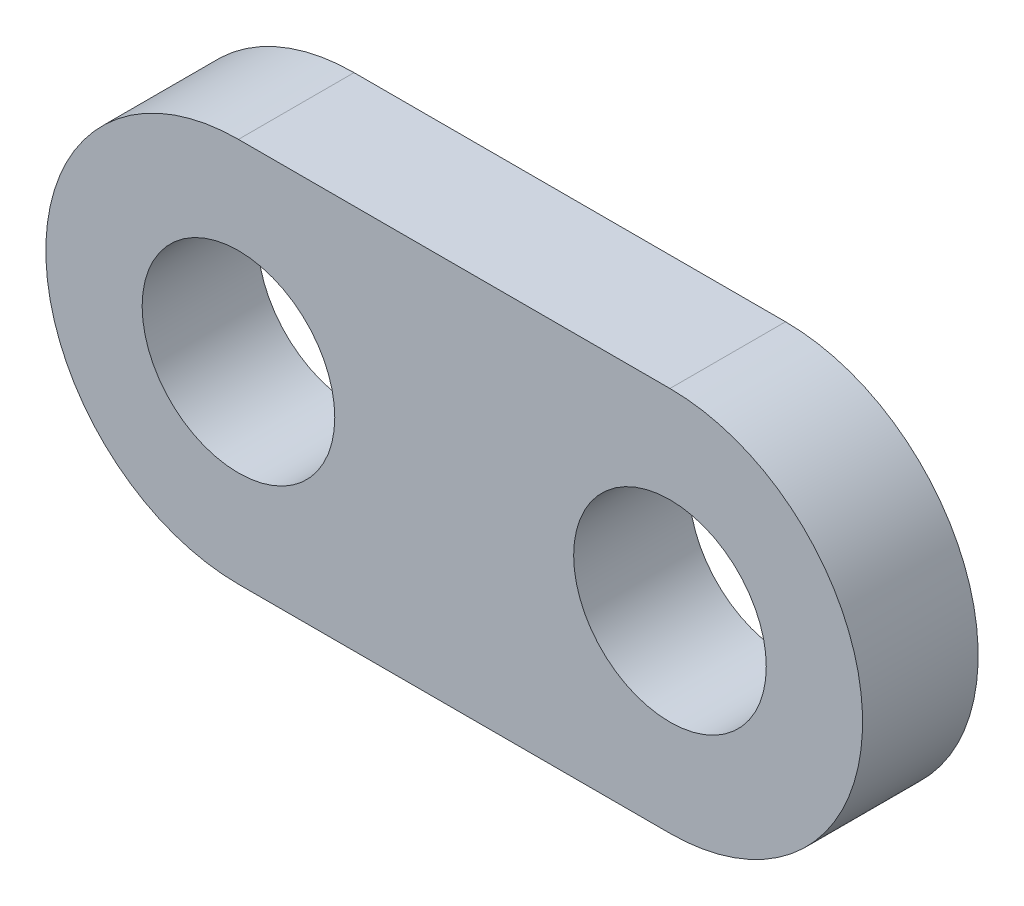
ISO-10303-21;
HEADER;
FILE_DESCRIPTION(('STEP AP214'),'2;1');
FILE_NAME('part.step','',(''),(''),'','','');
FILE_SCHEMA(('AUTOMOTIVE_DESIGN { 1 0 10303 214 1 1 1 1 }'));
ENDSEC;
DATA;
#1=APPLICATION_CONTEXT('core data for automotive mechanical design processes');
#2=APPLICATION_PROTOCOL_DEFINITION('international standard','automotive_design',2000,#1);
#3=PRODUCT_CONTEXT('',#1,'mechanical');
#4=PRODUCT('Part','Part','',(#3));
#5=PRODUCT_RELATED_PRODUCT_CATEGORY('part','',(#4));
#6=PRODUCT_DEFINITION_FORMATION('','',#4);
#7=PRODUCT_DEFINITION_CONTEXT('part definition',#1,'design');
#8=PRODUCT_DEFINITION('design','',#6,#7);
#9=PRODUCT_DEFINITION_SHAPE('','',#8);
#10=(LENGTH_UNIT() NAMED_UNIT(*) SI_UNIT(.MILLI.,.METRE.));
#11=(NAMED_UNIT(*) PLANE_ANGLE_UNIT() SI_UNIT($,.RADIAN.));
#12=(NAMED_UNIT(*) SI_UNIT($,.STERADIAN.) SOLID_ANGLE_UNIT());
#13=UNCERTAINTY_MEASURE_WITH_UNIT(LENGTH_MEASURE(1.E-05),#10,'distance_accuracy_value','');
#14=(GEOMETRIC_REPRESENTATION_CONTEXT(3) GLOBAL_UNCERTAINTY_ASSIGNED_CONTEXT((#13)) GLOBAL_UNIT_ASSIGNED_CONTEXT((#10,
#11,#12)) REPRESENTATION_CONTEXT('',''));
#15=CARTESIAN_POINT('',(0.,0.,0.));
#16=DIRECTION('',(0.,0.,1.));
#17=DIRECTION('',(1.,0.,0.));
#18=AXIS2_PLACEMENT_3D('',#15,#16,#17);
#19=CARTESIAN_POINT('',(-11.22423390278,0.,6.));
#20=DIRECTION('',(0.,0.,1.));
#21=DIRECTION('',(1.,0.,0.));
#22=AXIS2_PLACEMENT_3D('',#19,#20,#21);
#23=PLANE('',#22);
#24=CARTESIAN_POINT('',(-11.22423390278,0.,6.));
#25=DIRECTION('',(0.,0.,1.));
#26=DIRECTION('',(1.,0.,0.));
#27=AXIS2_PLACEMENT_3D('',#24,#25,#26);
#28=CIRCLE('',#27,5.);
#29=CARTESIAN_POINT('',(-6.22423390278005,0.,6.));
#30=VERTEX_POINT('',#29);
#31=EDGE_CURVE('E112',#30,#30,#28,.T.);
#32=ORIENTED_EDGE('',*,*,#31,.F.);
#33=EDGE_LOOP('',(#32));
#34=FACE_BOUND('',#33,.T.);
#35=CARTESIAN_POINT('',(-11.22423390278,0.,6.));
#36=DIRECTION('',(0.,0.,1.));
#37=DIRECTION('',(1.,0.,0.));
#38=AXIS2_PLACEMENT_3D('',#35,#36,#37);
#39=CIRCLE('',#38,10.);
#40=CARTESIAN_POINT('',(-11.22423390278,10.,6.));
#41=VERTEX_POINT('',#40);
#42=CARTESIAN_POINT('',(-11.22423390278,-10.,6.));
#43=VERTEX_POINT('',#42);
#44=EDGE_CURVE('E92',#41,#43,#39,.T.);
#45=ORIENTED_EDGE('',*,*,#44,.T.);
#46=DIRECTION('',(1.,0.,0.));
#47=VECTOR('',#46,1.);
#48=CARTESIAN_POINT('',(-11.22423390278,-10.,6.));
#49=LINE('',#48,#47);
#50=CARTESIAN_POINT('',(11.1757660972199,-10.,6.));
#51=VERTEX_POINT('',#50);
#52=EDGE_CURVE('E87',#43,#51,#49,.T.);
#53=ORIENTED_EDGE('',*,*,#52,.T.);
#54=CARTESIAN_POINT('',(11.17576609722,0.,6.));
#55=DIRECTION('',(0.,0.,1.));
#56=DIRECTION('',(1.,0.,0.));
#57=AXIS2_PLACEMENT_3D('',#54,#55,#56);
#58=CIRCLE('',#57,10.);
#59=CARTESIAN_POINT('',(11.17576609722,10.,6.));
#60=VERTEX_POINT('',#59);
#61=EDGE_CURVE('E90',#51,#60,#58,.T.);
#62=ORIENTED_EDGE('',*,*,#61,.T.);
#63=DIRECTION('',(-1.,0.,0.));
#64=VECTOR('',#63,1.);
#65=CARTESIAN_POINT('',(-11.22423390278,10.,6.));
#66=LINE('',#65,#64);
#67=EDGE_CURVE('E57',#60,#41,#66,.T.);
#68=ORIENTED_EDGE('',*,*,#67,.T.);
#69=EDGE_LOOP('',(#45,#53,#62,#68));
#70=FACE_BOUND('',#69,.T.);
#71=CARTESIAN_POINT('',(11.17576609722,0.,6.));
#72=DIRECTION('',(0.,0.,1.));
#73=DIRECTION('',(1.,0.,0.));
#74=AXIS2_PLACEMENT_3D('',#71,#72,#73);
#75=CIRCLE('',#74,5.);
#76=CARTESIAN_POINT('',(16.17576609722,0.,6.));
#77=VERTEX_POINT('',#76);
#78=EDGE_CURVE('E134',#77,#77,#75,.T.);
#79=ORIENTED_EDGE('',*,*,#78,.F.);
#80=EDGE_LOOP('',(#79));
#81=FACE_BOUND('',#80,.T.);
#82=ADVANCED_FACE('F39',(#34,#70,#81),#23,.T.);
#83=CARTESIAN_POINT('',(-11.22423390278,0.,0.));
#84=DIRECTION('',(0.,0.,1.));
#85=DIRECTION('',(1.,0.,0.));
#86=AXIS2_PLACEMENT_3D('',#83,#84,#85);
#87=PLANE('',#86);
#88=CARTESIAN_POINT('',(-11.22423390278,0.,0.));
#89=DIRECTION('',(0.,0.,1.));
#90=DIRECTION('',(1.,0.,0.));
#91=AXIS2_PLACEMENT_3D('',#88,#89,#90);
#92=CIRCLE('',#91,10.);
#93=CARTESIAN_POINT('',(-11.22423390278,10.,0.));
#94=VERTEX_POINT('',#93);
#95=CARTESIAN_POINT('',(-11.22423390278,-10.,0.));
#96=VERTEX_POINT('',#95);
#97=EDGE_CURVE('E108',#94,#96,#92,.T.);
#98=ORIENTED_EDGE('',*,*,#97,.F.);
#99=DIRECTION('',(-1.,0.,0.));
#100=VECTOR('',#99,1.);
#101=CARTESIAN_POINT('',(-11.22423390278,10.,0.));
#102=LINE('',#101,#100);
#103=CARTESIAN_POINT('',(11.17576609722,10.,0.));
#104=VERTEX_POINT('',#103);
#105=EDGE_CURVE('E80',#104,#94,#102,.T.);
#106=ORIENTED_EDGE('',*,*,#105,.F.);
#107=CARTESIAN_POINT('',(11.17576609722,0.,0.));
#108=DIRECTION('',(0.,0.,1.));
#109=DIRECTION('',(1.,0.,0.));
#110=AXIS2_PLACEMENT_3D('',#107,#108,#109);
#111=CIRCLE('',#110,10.);
#112=CARTESIAN_POINT('',(11.1757660972199,-10.,0.));
#113=VERTEX_POINT('',#112);
#114=EDGE_CURVE('E74',#113,#104,#111,.T.);
#115=ORIENTED_EDGE('',*,*,#114,.F.);
#116=DIRECTION('',(1.,0.,0.));
#117=VECTOR('',#116,1.);
#118=CARTESIAN_POINT('',(-11.22423390278,-10.,0.));
#119=LINE('',#118,#117);
#120=EDGE_CURVE('E97',#96,#113,#119,.T.);
#121=ORIENTED_EDGE('',*,*,#120,.F.);
#122=EDGE_LOOP('',(#98,#106,#115,#121));
#123=FACE_BOUND('',#122,.T.);
#124=CARTESIAN_POINT('',(-11.22423390278,0.,0.));
#125=DIRECTION('',(0.,0.,1.));
#126=DIRECTION('',(1.,0.,0.));
#127=AXIS2_PLACEMENT_3D('',#124,#125,#126);
#128=CIRCLE('',#127,5.);
#129=CARTESIAN_POINT('',(-6.22423390278005,0.,0.));
#130=VERTEX_POINT('',#129);
#131=EDGE_CURVE('E130',#130,#130,#128,.T.);
#132=ORIENTED_EDGE('',*,*,#131,.T.);
#133=EDGE_LOOP('',(#132));
#134=FACE_BOUND('',#133,.T.);
#135=CARTESIAN_POINT('',(11.17576609722,0.,0.));
#136=DIRECTION('',(0.,0.,1.));
#137=DIRECTION('',(1.,0.,0.));
#138=AXIS2_PLACEMENT_3D('',#135,#136,#137);
#139=CIRCLE('',#138,5.);
#140=CARTESIAN_POINT('',(16.17576609722,0.,0.));
#141=VERTEX_POINT('',#140);
#142=EDGE_CURVE('E138',#141,#141,#139,.T.);
#143=ORIENTED_EDGE('',*,*,#142,.T.);
#144=EDGE_LOOP('',(#143));
#145=FACE_BOUND('',#144,.T.);
#146=ADVANCED_FACE('F125',(#123,#134,#145),#87,.F.);
#147=CARTESIAN_POINT('',(-11.22423390278,0.,6.));
#148=DIRECTION('',(0.,0.,-1.));
#149=DIRECTION('',(-1.,0.,0.));
#150=AXIS2_PLACEMENT_3D('',#147,#148,#149);
#151=CYLINDRICAL_SURFACE('',#150,10.);
#152=ORIENTED_EDGE('',*,*,#97,.T.);
#153=DIRECTION('',(0.,0.,-1.));
#154=VECTOR('',#153,1.);
#155=CARTESIAN_POINT('',(-11.22423390278,-10.,6.));
#156=LINE('',#155,#154);
#157=EDGE_CURVE('E11',#43,#96,#156,.T.);
#158=ORIENTED_EDGE('',*,*,#157,.F.);
#159=ORIENTED_EDGE('',*,*,#44,.F.);
#160=DIRECTION('',(0.,0.,-1.));
#161=VECTOR('',#160,1.);
#162=CARTESIAN_POINT('',(-11.22423390278,10.,6.));
#163=LINE('',#162,#161);
#164=EDGE_CURVE('E104',#41,#94,#163,.T.);
#165=ORIENTED_EDGE('',*,*,#164,.T.);
#166=EDGE_LOOP('',(#152,#158,#159,#165));
#167=FACE_BOUND('',#166,.T.);
#168=ADVANCED_FACE('F41',(#167),#151,.T.);
#169=CARTESIAN_POINT('',(-11.22423390278,-10.,6.));
#170=DIRECTION('',(0.,1.,0.));
#171=DIRECTION('',(0.,0.,1.));
#172=AXIS2_PLACEMENT_3D('',#169,#170,#171);
#173=PLANE('',#172);
#174=ORIENTED_EDGE('',*,*,#120,.T.);
#175=DIRECTION('',(0.,0.,-1.));
#176=VECTOR('',#175,1.);
#177=CARTESIAN_POINT('',(11.1757660972199,-10.,6.));
#178=LINE('',#177,#176);
#179=EDGE_CURVE('E49',#51,#113,#178,.T.);
#180=ORIENTED_EDGE('',*,*,#179,.F.);
#181=ORIENTED_EDGE('',*,*,#52,.F.);
#182=ORIENTED_EDGE('',*,*,#157,.T.);
#183=EDGE_LOOP('',(#174,#180,#181,#182));
#184=FACE_BOUND('',#183,.T.);
#185=ADVANCED_FACE('F96',(#184),#173,.F.);
#186=CARTESIAN_POINT('',(11.17576609722,0.,6.));
#187=DIRECTION('',(0.,0.,-1.));
#188=DIRECTION('',(-1.,0.,0.));
#189=AXIS2_PLACEMENT_3D('',#186,#187,#188);
#190=CYLINDRICAL_SURFACE('',#189,10.);
#191=ORIENTED_EDGE('',*,*,#114,.T.);
#192=DIRECTION('',(0.,0.,-1.));
#193=VECTOR('',#192,1.);
#194=CARTESIAN_POINT('',(11.17576609722,10.,6.));
#195=LINE('',#194,#193);
#196=EDGE_CURVE('E99',#60,#104,#195,.T.);
#197=ORIENTED_EDGE('',*,*,#196,.F.);
#198=ORIENTED_EDGE('',*,*,#61,.F.);
#199=ORIENTED_EDGE('',*,*,#179,.T.);
#200=EDGE_LOOP('',(#191,#197,#198,#199));
#201=FACE_BOUND('',#200,.T.);
#202=ADVANCED_FACE('F100',(#201),#190,.T.);
#203=CARTESIAN_POINT('',(-11.22423390278,10.,6.));
#204=DIRECTION('',(0.,-1.,0.));
#205=DIRECTION('',(0.,0.,-1.));
#206=AXIS2_PLACEMENT_3D('',#203,#204,#205);
#207=PLANE('',#206);
#208=ORIENTED_EDGE('',*,*,#105,.T.);
#209=ORIENTED_EDGE('',*,*,#164,.F.);
#210=ORIENTED_EDGE('',*,*,#67,.F.);
#211=ORIENTED_EDGE('',*,*,#196,.T.);
#212=EDGE_LOOP('',(#208,#209,#210,#211));
#213=FACE_BOUND('',#212,.T.);
#214=ADVANCED_FACE('F122',(#213),#207,.F.);
#215=CARTESIAN_POINT('',(-11.22423390278,0.,6.));
#216=DIRECTION('',(0.,0.,-1.));
#217=DIRECTION('',(-1.,0.,0.));
#218=AXIS2_PLACEMENT_3D('',#215,#216,#217);
#219=CYLINDRICAL_SURFACE('',#218,5.);
#220=ORIENTED_EDGE('',*,*,#31,.T.);
#221=EDGE_LOOP('',(#220));
#222=FACE_BOUND('',#221,.T.);
#223=ORIENTED_EDGE('',*,*,#131,.F.);
#224=EDGE_LOOP('',(#223));
#225=FACE_BOUND('',#224,.T.);
#226=ADVANCED_FACE('F157',(#222,#225),#219,.F.);
#227=CARTESIAN_POINT('',(11.17576609722,0.,6.));
#228=DIRECTION('',(0.,0.,-1.));
#229=DIRECTION('',(-1.,0.,0.));
#230=AXIS2_PLACEMENT_3D('',#227,#228,#229);
#231=CYLINDRICAL_SURFACE('',#230,5.);
#232=ORIENTED_EDGE('',*,*,#78,.T.);
#233=EDGE_LOOP('',(#232));
#234=FACE_BOUND('',#233,.T.);
#235=ORIENTED_EDGE('',*,*,#142,.F.);
#236=EDGE_LOOP('',(#235));
#237=FACE_BOUND('',#236,.T.);
#238=ADVANCED_FACE('F146',(#234,#237),#231,.F.);
#239=CLOSED_SHELL('',(#82,#146,#168,#185,#202,#214,#226,#238));
#240=MANIFOLD_SOLID_BREP('B2',#239);
#241=ADVANCED_BREP_SHAPE_REPRESENTATION('',(#18,#240),#14);
#242=SHAPE_DEFINITION_REPRESENTATION(#9,#241);
ENDSEC;
END-ISO-10303-21;
